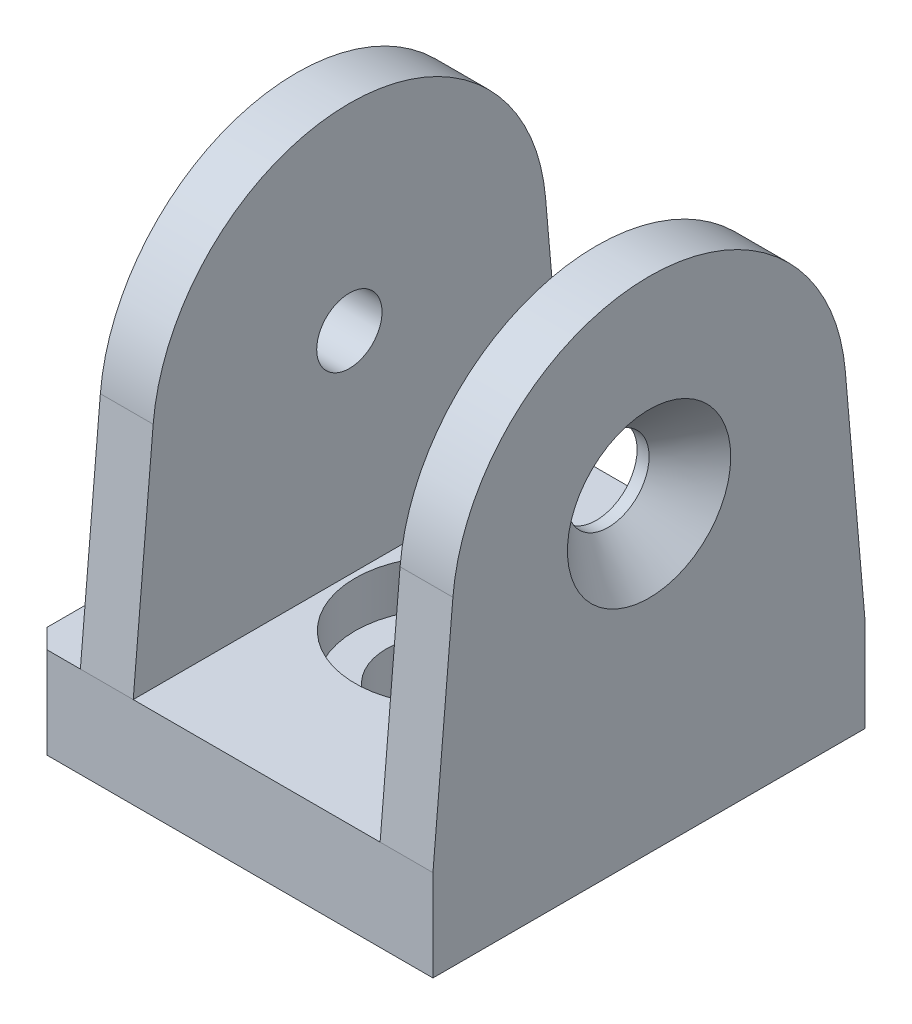
ISO-10303-21;
HEADER;
FILE_DESCRIPTION(('STEP AP214'),'2;1');
FILE_NAME('part.step','',(''),(''),'','','');
FILE_SCHEMA(('AUTOMOTIVE_DESIGN { 1 0 10303 214 1 1 1 1 }'));
ENDSEC;
DATA;
#1=APPLICATION_CONTEXT('core data for automotive mechanical design processes');
#2=APPLICATION_PROTOCOL_DEFINITION('international standard','automotive_design',2000,#1);
#3=PRODUCT_CONTEXT('',#1,'mechanical');
#4=PRODUCT('Part','Part','',(#3));
#5=PRODUCT_RELATED_PRODUCT_CATEGORY('part','',(#4));
#6=PRODUCT_DEFINITION_FORMATION('','',#4);
#7=PRODUCT_DEFINITION_CONTEXT('part definition',#1,'design');
#8=PRODUCT_DEFINITION('design','',#6,#7);
#9=PRODUCT_DEFINITION_SHAPE('','',#8);
#10=(LENGTH_UNIT() NAMED_UNIT(*) SI_UNIT(.MILLI.,.METRE.));
#11=(NAMED_UNIT(*) PLANE_ANGLE_UNIT() SI_UNIT($,.RADIAN.));
#12=(NAMED_UNIT(*) SI_UNIT($,.STERADIAN.) SOLID_ANGLE_UNIT());
#13=UNCERTAINTY_MEASURE_WITH_UNIT(LENGTH_MEASURE(1.E-05),#10,'distance_accuracy_value','');
#14=(GEOMETRIC_REPRESENTATION_CONTEXT(3) GLOBAL_UNCERTAINTY_ASSIGNED_CONTEXT((#13)) GLOBAL_UNIT_ASSIGNED_CONTEXT((#10,
#11,#12)) REPRESENTATION_CONTEXT('',''));
#15=CARTESIAN_POINT('',(0.,0.,0.));
#16=DIRECTION('',(0.,0.,1.));
#17=DIRECTION('',(1.,0.,0.));
#18=AXIS2_PLACEMENT_3D('',#15,#16,#17);
#19=CARTESIAN_POINT('',(-15.6,33.2840876711679,-20.4222190562531));
#20=DIRECTION('',(0.,0.0870286668862405,-0.996205807622102));
#21=DIRECTION('',(0.,0.996205807622102,0.0870286668862405));
#22=AXIS2_PLACEMENT_3D('',#19,#20,#21);
#23=PLANE('',#22);
#24=DIRECTION('',(0.,-0.996205807622102,-0.0870286668862405));
#25=VECTOR('',#24,1.);
#26=CARTESIAN_POINT('',(15.6,33.2840876711679,-20.4222190562531));
#27=LINE('',#26,#25);
#28=CARTESIAN_POINT('',(15.6,33.2840876711679,-20.4222190562531));
#29=VERTEX_POINT('',#28);
#30=CARTESIAN_POINT('',(15.6,9.5,-22.5));
#31=VERTEX_POINT('',#30);
#32=EDGE_CURVE('E145',#29,#31,#27,.T.);
#33=ORIENTED_EDGE('',*,*,#32,.F.);
#34=DIRECTION('',(1.,0.,0.));
#35=VECTOR('',#34,1.);
#36=CARTESIAN_POINT('',(-15.6,33.2840876711679,-20.4222190562531));
#37=LINE('',#36,#35);
#38=CARTESIAN_POINT('',(21.1,33.2840876711679,-20.4222190562531));
#39=VERTEX_POINT('',#38);
#40=EDGE_CURVE('E190',#29,#39,#37,.T.);
#41=ORIENTED_EDGE('',*,*,#40,.T.);
#42=DIRECTION('',(0.,0.996205807622102,0.0870286668862405));
#43=VECTOR('',#42,1.);
#44=CARTESIAN_POINT('',(21.1,33.2840876711679,-20.4222190562531));
#45=LINE('',#44,#43);
#46=CARTESIAN_POINT('',(21.1,9.5,-22.5));
#47=VERTEX_POINT('',#46);
#48=EDGE_CURVE('E258',#47,#39,#45,.T.);
#49=ORIENTED_EDGE('',*,*,#48,.F.);
#50=DIRECTION('',(-1.,0.,0.));
#51=VECTOR('',#50,1.);
#52=CARTESIAN_POINT('',(21.1,9.5,-22.5));
#53=LINE('',#52,#51);
#54=EDGE_CURVE('E211',#47,#31,#53,.T.);
#55=ORIENTED_EDGE('',*,*,#54,.T.);
#56=EDGE_LOOP('',(#33,#41,#49,#55));
#57=FACE_BOUND('',#56,.T.);
#58=ADVANCED_FACE('F39',(#57),#23,.T.);
#59=CARTESIAN_POINT('',(-15.6,31.5,0.));
#60=DIRECTION('',(1.,0.,0.));
#61=DIRECTION('',(0.,0.,-1.));
#62=AXIS2_PLACEMENT_3D('',#59,#60,#61);
#63=CYLINDRICAL_SURFACE('',#62,20.5);
#64=DIRECTION('',(1.,0.,0.));
#65=VECTOR('',#64,1.);
#66=CARTESIAN_POINT('',(-15.6,33.2840876711679,20.4222190562531));
#67=LINE('',#66,#65);
#68=CARTESIAN_POINT('',(-15.6,33.2840876711679,20.4222190562531));
#69=VERTEX_POINT('',#68);
#70=CARTESIAN_POINT('',(-10.1,33.2840876711679,20.4222190562531));
#71=VERTEX_POINT('',#70);
#72=EDGE_CURVE('E178',#69,#71,#67,.T.);
#73=ORIENTED_EDGE('',*,*,#72,.T.);
#74=CARTESIAN_POINT('',(-10.1,31.5,0.));
#75=DIRECTION('',(-1.,0.,0.));
#76=DIRECTION('',(0.,-1.,0.));
#77=AXIS2_PLACEMENT_3D('',#74,#75,#76);
#78=CIRCLE('',#77,20.5);
#79=CARTESIAN_POINT('',(-10.1,33.2840876711679,-20.4222190562531));
#80=VERTEX_POINT('',#79);
#81=EDGE_CURVE('E149',#80,#71,#78,.F.);
#82=ORIENTED_EDGE('',*,*,#81,.F.);
#83=CARTESIAN_POINT('',(-15.6,33.2840876711679,-20.4222190562531));
#84=VERTEX_POINT('',#83);
#85=EDGE_CURVE('E187',#84,#80,#37,.T.);
#86=ORIENTED_EDGE('',*,*,#85,.F.);
#87=CARTESIAN_POINT('',(-15.6,31.5,0.));
#88=DIRECTION('',(1.,0.,0.));
#89=DIRECTION('',(0.,0.,1.));
#90=AXIS2_PLACEMENT_3D('',#87,#88,#89);
#91=CIRCLE('',#90,20.5);
#92=EDGE_CURVE('E313',#84,#69,#91,.T.);
#93=ORIENTED_EDGE('',*,*,#92,.T.);
#94=EDGE_LOOP('',(#73,#82,#86,#93));
#95=FACE_BOUND('',#94,.T.);
#96=ADVANCED_FACE('F273',(#95),#63,.T.);
#97=CARTESIAN_POINT('',(-15.6,9.5,22.5));
#98=DIRECTION('',(0.,0.0870286668862404,0.996205807622102));
#99=DIRECTION('',(0.,-0.996205807622102,0.0870286668862404));
#100=AXIS2_PLACEMENT_3D('',#97,#98,#99);
#101=PLANE('',#100);
#102=DIRECTION('',(0.,0.996205807622102,-0.0870286668862404));
#103=VECTOR('',#102,1.);
#104=CARTESIAN_POINT('',(15.6,9.5,22.5));
#105=LINE('',#104,#103);
#106=CARTESIAN_POINT('',(15.6,9.5,22.5));
#107=VERTEX_POINT('',#106);
#108=CARTESIAN_POINT('',(15.6,33.2840876711679,20.4222190562531));
#109=VERTEX_POINT('',#108);
#110=EDGE_CURVE('E142',#107,#109,#105,.T.);
#111=ORIENTED_EDGE('',*,*,#110,.F.);
#112=DIRECTION('',(1.,0.,0.));
#113=VECTOR('',#112,1.);
#114=CARTESIAN_POINT('',(-15.6,9.5,22.5));
#115=LINE('',#114,#113);
#116=CARTESIAN_POINT('',(21.1,9.5,22.5));
#117=VERTEX_POINT('',#116);
#118=EDGE_CURVE('E167',#107,#117,#115,.T.);
#119=ORIENTED_EDGE('',*,*,#118,.T.);
#120=DIRECTION('',(0.,-0.996205807622102,0.0870286668862404));
#121=VECTOR('',#120,1.);
#122=CARTESIAN_POINT('',(21.1,9.5,22.5));
#123=LINE('',#122,#121);
#124=CARTESIAN_POINT('',(21.1,33.2840876711679,20.4222190562531));
#125=VERTEX_POINT('',#124);
#126=EDGE_CURVE('E184',#125,#117,#123,.T.);
#127=ORIENTED_EDGE('',*,*,#126,.F.);
#128=EDGE_CURVE('E169',#109,#125,#67,.T.);
#129=ORIENTED_EDGE('',*,*,#128,.F.);
#130=EDGE_LOOP('',(#111,#119,#127,#129));
#131=FACE_BOUND('',#130,.T.);
#132=ADVANCED_FACE('F165',(#131),#101,.T.);
#133=CARTESIAN_POINT('',(0.,9.5,0.));
#134=DIRECTION('',(0.,1.,0.));
#135=DIRECTION('',(0.,0.,1.));
#136=AXIS2_PLACEMENT_3D('',#133,#134,#135);
#137=PLANE('',#136);
#138=CARTESIAN_POINT('',(-15.6,9.5,-22.5));
#139=VERTEX_POINT('',#138);
#140=CARTESIAN_POINT('',(-19.1,9.5,-22.5));
#141=VERTEX_POINT('',#140);
#142=EDGE_CURVE('E210',#139,#141,#53,.T.);
#143=ORIENTED_EDGE('',*,*,#142,.T.);
#144=DIRECTION('',(0.707106781186549,0.,-0.707106781186546));
#145=VECTOR('',#144,1.);
#146=CARTESIAN_POINT('',(-20.8,9.5,-20.8));
#147=LINE('',#146,#145);
#148=CARTESIAN_POINT('',(-21.1,9.5,-20.5));
#149=VERTEX_POINT('',#148);
#150=EDGE_CURVE('E48',#141,#149,#147,.F.);
#151=ORIENTED_EDGE('',*,*,#150,.T.);
#152=DIRECTION('',(0.,0.,1.));
#153=VECTOR('',#152,1.);
#154=CARTESIAN_POINT('',(-21.1,9.5,22.5));
#155=LINE('',#154,#153);
#156=CARTESIAN_POINT('',(-21.1,9.5,20.5));
#157=VERTEX_POINT('',#156);
#158=EDGE_CURVE('E205',#149,#157,#155,.T.);
#159=ORIENTED_EDGE('',*,*,#158,.T.);
#160=DIRECTION('',(-0.707106781186546,0.,-0.707106781186549));
#161=VECTOR('',#160,1.);
#162=CARTESIAN_POINT('',(-20.8,9.5,20.8));
#163=LINE('',#162,#161);
#164=CARTESIAN_POINT('',(-19.1,9.5,22.5));
#165=VERTEX_POINT('',#164);
#166=EDGE_CURVE('E55',#157,#165,#163,.F.);
#167=ORIENTED_EDGE('',*,*,#166,.T.);
#168=DIRECTION('',(1.,0.,0.));
#169=VECTOR('',#168,1.);
#170=CARTESIAN_POINT('',(21.1,9.5,22.5));
#171=LINE('',#170,#169);
#172=CARTESIAN_POINT('',(-15.6,9.5,22.5));
#173=VERTEX_POINT('',#172);
#174=EDGE_CURVE('E207',#165,#173,#171,.T.);
#175=ORIENTED_EDGE('',*,*,#174,.T.);
#176=DIRECTION('',(0.,0.,-1.));
#177=VECTOR('',#176,1.);
#178=CARTESIAN_POINT('',(-15.6,9.5,-22.5));
#179=LINE('',#178,#177);
#180=EDGE_CURVE('E318',#173,#139,#179,.T.);
#181=ORIENTED_EDGE('',*,*,#180,.T.);
#182=EDGE_LOOP('',(#143,#151,#159,#167,#175,#181));
#183=FACE_BOUND('',#182,.T.);
#184=ADVANCED_FACE('F238',(#183),#137,.T.);
#185=CARTESIAN_POINT('',(-21.1,9.5,22.5));
#186=DIRECTION('',(1.,0.,0.));
#187=DIRECTION('',(0.,0.,-1.));
#188=AXIS2_PLACEMENT_3D('',#185,#186,#187);
#189=PLANE('',#188);
#190=ORIENTED_EDGE('',*,*,#158,.F.);
#191=DIRECTION('',(0.,-1.,0.));
#192=VECTOR('',#191,1.);
#193=CARTESIAN_POINT('',(-21.1,9.5,-20.5));
#194=LINE('',#193,#192);
#195=CARTESIAN_POINT('',(-21.1,0.,-20.5));
#196=VERTEX_POINT('',#195);
#197=EDGE_CURVE('E228',#149,#196,#194,.T.);
#198=ORIENTED_EDGE('',*,*,#197,.T.);
#199=DIRECTION('',(0.,0.,1.));
#200=VECTOR('',#199,1.);
#201=CARTESIAN_POINT('',(-21.1,0.,22.5));
#202=LINE('',#201,#200);
#203=CARTESIAN_POINT('',(-21.1,0.,20.5));
#204=VERTEX_POINT('',#203);
#205=EDGE_CURVE('E204',#196,#204,#202,.T.);
#206=ORIENTED_EDGE('',*,*,#205,.T.);
#207=DIRECTION('',(0.,1.,0.));
#208=VECTOR('',#207,1.);
#209=CARTESIAN_POINT('',(-21.1,9.5,20.5));
#210=LINE('',#209,#208);
#211=EDGE_CURVE('E170',#204,#157,#210,.T.);
#212=ORIENTED_EDGE('',*,*,#211,.T.);
#213=EDGE_LOOP('',(#190,#198,#206,#212));
#214=FACE_BOUND('',#213,.T.);
#215=ADVANCED_FACE('F243',(#214),#189,.F.);
#216=CARTESIAN_POINT('',(21.1,9.5,22.5));
#217=DIRECTION('',(0.,0.,-1.));
#218=DIRECTION('',(-1.,0.,0.));
#219=AXIS2_PLACEMENT_3D('',#216,#217,#218);
#220=PLANE('',#219);
#221=ORIENTED_EDGE('',*,*,#174,.F.);
#222=DIRECTION('',(0.,-1.,0.));
#223=VECTOR('',#222,1.);
#224=CARTESIAN_POINT('',(-19.1,9.5,22.5));
#225=LINE('',#224,#223);
#226=CARTESIAN_POINT('',(-19.1,0.,22.5));
#227=VERTEX_POINT('',#226);
#228=EDGE_CURVE('E11',#165,#227,#225,.T.);
#229=ORIENTED_EDGE('',*,*,#228,.T.);
#230=DIRECTION('',(1.,0.,0.));
#231=VECTOR('',#230,1.);
#232=CARTESIAN_POINT('',(21.1,0.,22.5));
#233=LINE('',#232,#231);
#234=CARTESIAN_POINT('',(21.1,0.,22.5));
#235=VERTEX_POINT('',#234);
#236=EDGE_CURVE('E218',#227,#235,#233,.T.);
#237=ORIENTED_EDGE('',*,*,#236,.T.);
#238=DIRECTION('',(0.,-1.,0.));
#239=VECTOR('',#238,1.);
#240=CARTESIAN_POINT('',(21.1,9.5,22.5));
#241=LINE('',#240,#239);
#242=EDGE_CURVE('E176',#117,#235,#241,.T.);
#243=ORIENTED_EDGE('',*,*,#242,.F.);
#244=ORIENTED_EDGE('',*,*,#118,.F.);
#245=DIRECTION('',(1.,0.,0.));
#246=VECTOR('',#245,1.);
#247=CARTESIAN_POINT('',(15.6,9.5,22.5));
#248=LINE('',#247,#246);
#249=CARTESIAN_POINT('',(-10.1,9.5,22.5));
#250=VERTEX_POINT('',#249);
#251=EDGE_CURVE('E153',#250,#107,#248,.T.);
#252=ORIENTED_EDGE('',*,*,#251,.F.);
#253=EDGE_CURVE('E177',#173,#250,#115,.T.);
#254=ORIENTED_EDGE('',*,*,#253,.F.);
#255=EDGE_LOOP('',(#221,#229,#237,#243,#244,#252,#254));
#256=FACE_BOUND('',#255,.T.);
#257=ADVANCED_FACE('F174',(#256),#220,.F.);
#258=CARTESIAN_POINT('',(21.1,9.5,22.5));
#259=DIRECTION('',(-1.,0.,0.));
#260=DIRECTION('',(0.,0.,1.));
#261=AXIS2_PLACEMENT_3D('',#258,#259,#260);
#262=PLANE('',#261);
#263=CARTESIAN_POINT('',(21.1,31.5,0.));
#264=DIRECTION('',(1.,0.,0.));
#265=DIRECTION('',(0.,0.,-1.));
#266=AXIS2_PLACEMENT_3D('',#263,#264,#265);
#267=CIRCLE('',#266,8.5);
#268=CARTESIAN_POINT('',(21.1,31.5,-8.5));
#269=VERTEX_POINT('',#268);
#270=EDGE_CURVE('E328',#269,#269,#267,.T.);
#271=ORIENTED_EDGE('',*,*,#270,.F.);
#272=EDGE_LOOP('',(#271));
#273=FACE_BOUND('',#272,.T.);
#274=DIRECTION('',(0.,0.,-1.));
#275=VECTOR('',#274,1.);
#276=CARTESIAN_POINT('',(21.1,0.,22.5));
#277=LINE('',#276,#275);
#278=CARTESIAN_POINT('',(21.1,0.,-22.5));
#279=VERTEX_POINT('',#278);
#280=EDGE_CURVE('E220',#235,#279,#277,.T.);
#281=ORIENTED_EDGE('',*,*,#280,.T.);
#282=DIRECTION('',(0.,-1.,0.));
#283=VECTOR('',#282,1.);
#284=CARTESIAN_POINT('',(21.1,9.5,-22.5));
#285=LINE('',#284,#283);
#286=EDGE_CURVE('E214',#47,#279,#285,.T.);
#287=ORIENTED_EDGE('',*,*,#286,.F.);
#288=ORIENTED_EDGE('',*,*,#48,.T.);
#289=CARTESIAN_POINT('',(21.1,31.5,0.));
#290=DIRECTION('',(1.,0.,0.));
#291=DIRECTION('',(0.,0.,1.));
#292=AXIS2_PLACEMENT_3D('',#289,#290,#291);
#293=CIRCLE('',#292,20.5);
#294=EDGE_CURVE('E306',#39,#125,#293,.T.);
#295=ORIENTED_EDGE('',*,*,#294,.T.);
#296=ORIENTED_EDGE('',*,*,#126,.T.);
#297=ORIENTED_EDGE('',*,*,#242,.T.);
#298=EDGE_LOOP('',(#281,#287,#288,#295,#296,#297));
#299=FACE_BOUND('',#298,.T.);
#300=ADVANCED_FACE('F256',(#273,#299),#262,.F.);
#301=CARTESIAN_POINT('',(21.1,9.5,-22.5));
#302=DIRECTION('',(0.,0.,1.));
#303=DIRECTION('',(1.,0.,0.));
#304=AXIS2_PLACEMENT_3D('',#301,#302,#303);
#305=PLANE('',#304);
#306=DIRECTION('',(-1.,0.,0.));
#307=VECTOR('',#306,1.);
#308=CARTESIAN_POINT('',(21.1,0.,-22.5));
#309=LINE('',#308,#307);
#310=CARTESIAN_POINT('',(-19.1,0.,-22.5));
#311=VERTEX_POINT('',#310);
#312=EDGE_CURVE('E208',#279,#311,#309,.T.);
#313=ORIENTED_EDGE('',*,*,#312,.T.);
#314=DIRECTION('',(0.,1.,0.));
#315=VECTOR('',#314,1.);
#316=CARTESIAN_POINT('',(-19.1,9.5,-22.5));
#317=LINE('',#316,#315);
#318=EDGE_CURVE('E63',#311,#141,#317,.T.);
#319=ORIENTED_EDGE('',*,*,#318,.T.);
#320=ORIENTED_EDGE('',*,*,#142,.F.);
#321=CARTESIAN_POINT('',(-10.1,9.5,-22.5));
#322=VERTEX_POINT('',#321);
#323=EDGE_CURVE('E215',#322,#139,#53,.T.);
#324=ORIENTED_EDGE('',*,*,#323,.F.);
#325=DIRECTION('',(1.,0.,0.));
#326=VECTOR('',#325,1.);
#327=CARTESIAN_POINT('',(15.6,9.5,-22.5));
#328=LINE('',#327,#326);
#329=EDGE_CURVE('E161',#322,#31,#328,.T.);
#330=ORIENTED_EDGE('',*,*,#329,.T.);
#331=ORIENTED_EDGE('',*,*,#54,.F.);
#332=ORIENTED_EDGE('',*,*,#286,.T.);
#333=EDGE_LOOP('',(#313,#319,#320,#324,#330,#331,#332));
#334=FACE_BOUND('',#333,.T.);
#335=ADVANCED_FACE('F251',(#334),#305,.F.);
#336=CARTESIAN_POINT('',(0.,0.,0.));
#337=DIRECTION('',(0.,1.,0.));
#338=DIRECTION('',(0.,0.,1.));
#339=AXIS2_PLACEMENT_3D('',#336,#337,#338);
#340=PLANE('',#339);
#341=CARTESIAN_POINT('',(0.,0.,0.));
#342=DIRECTION('',(0.,1.,0.));
#343=DIRECTION('',(-1.,0.,0.));
#344=AXIS2_PLACEMENT_3D('',#341,#342,#343);
#345=CIRCLE('',#344,6.25);
#346=CARTESIAN_POINT('',(-6.25,0.,0.));
#347=VERTEX_POINT('',#346);
#348=EDGE_CURVE('E201',#347,#347,#345,.T.);
#349=ORIENTED_EDGE('',*,*,#348,.T.);
#350=EDGE_LOOP('',(#349));
#351=FACE_BOUND('',#350,.T.);
#352=ORIENTED_EDGE('',*,*,#205,.F.);
#353=DIRECTION('',(-0.707106781186549,0.,0.707106781186546));
#354=VECTOR('',#353,1.);
#355=CARTESIAN_POINT('',(-21.1,0.,-20.5));
#356=LINE('',#355,#354);
#357=EDGE_CURVE('E233',#196,#311,#356,.F.);
#358=ORIENTED_EDGE('',*,*,#357,.T.);
#359=ORIENTED_EDGE('',*,*,#312,.F.);
#360=ORIENTED_EDGE('',*,*,#280,.F.);
#361=ORIENTED_EDGE('',*,*,#236,.F.);
#362=DIRECTION('',(0.707106781186546,0.,0.707106781186549));
#363=VECTOR('',#362,1.);
#364=CARTESIAN_POINT('',(-19.1,0.,22.5));
#365=LINE('',#364,#363);
#366=EDGE_CURVE('E231',#227,#204,#365,.F.);
#367=ORIENTED_EDGE('',*,*,#366,.T.);
#368=EDGE_LOOP('',(#352,#358,#359,#360,#361,#367));
#369=FACE_BOUND('',#368,.T.);
#370=ADVANCED_FACE('F249',(#351,#369),#340,.F.);
#371=CARTESIAN_POINT('',(0.,9.5,0.));
#372=DIRECTION('',(0.,1.,0.));
#373=DIRECTION('',(-1.,0.,0.));
#374=AXIS2_PLACEMENT_3D('',#371,#372,#373);
#375=CYLINDRICAL_SURFACE('',#374,6.25);
#376=ORIENTED_EDGE('',*,*,#348,.F.);
#377=EDGE_LOOP('',(#376));
#378=FACE_BOUND('',#377,.T.);
#379=CARTESIAN_POINT('',(0.,4.75,0.));
#380=DIRECTION('',(0.,1.,0.));
#381=DIRECTION('',(-1.,0.,0.));
#382=AXIS2_PLACEMENT_3D('',#379,#380,#381);
#383=CIRCLE('',#382,6.25);
#384=CARTESIAN_POINT('',(-6.25,4.75,0.));
#385=VERTEX_POINT('',#384);
#386=EDGE_CURVE('E198',#385,#385,#383,.T.);
#387=ORIENTED_EDGE('',*,*,#386,.T.);
#388=EDGE_LOOP('',(#387));
#389=FACE_BOUND('',#388,.T.);
#390=ADVANCED_FACE('F370',(#378,#389),#375,.F.);
#391=CARTESIAN_POINT('',(-6.25,4.75,0.));
#392=DIRECTION('',(0.,-1.,0.));
#393=DIRECTION('',(1.,0.,0.));
#394=AXIS2_PLACEMENT_3D('',#391,#392,#393);
#395=PLANE('',#394);
#396=ORIENTED_EDGE('',*,*,#386,.F.);
#397=EDGE_LOOP('',(#396));
#398=FACE_BOUND('',#397,.T.);
#399=CARTESIAN_POINT('',(0.,4.75000000000001,0.));
#400=DIRECTION('',(0.,1.,0.));
#401=DIRECTION('',(-1.,0.,0.));
#402=AXIS2_PLACEMENT_3D('',#399,#400,#401);
#403=CIRCLE('',#402,9.5);
#404=CARTESIAN_POINT('',(-9.5,4.75,0.));
#405=VERTEX_POINT('',#404);
#406=EDGE_CURVE('E180',#405,#405,#403,.T.);
#407=ORIENTED_EDGE('',*,*,#406,.T.);
#408=EDGE_LOOP('',(#407));
#409=FACE_BOUND('',#408,.T.);
#410=ADVANCED_FACE('F410',(#398,#409),#395,.F.);
#411=CARTESIAN_POINT('',(0.,9.5,0.));
#412=DIRECTION('',(0.,1.,0.));
#413=DIRECTION('',(-1.,0.,0.));
#414=AXIS2_PLACEMENT_3D('',#411,#412,#413);
#415=CYLINDRICAL_SURFACE('',#414,9.5);
#416=ORIENTED_EDGE('',*,*,#406,.F.);
#417=EDGE_LOOP('',(#416));
#418=FACE_BOUND('',#417,.T.);
#419=CARTESIAN_POINT('',(0.,9.50000000000001,0.));
#420=DIRECTION('',(0.,1.,0.));
#421=DIRECTION('',(-1.,0.,0.));
#422=AXIS2_PLACEMENT_3D('',#419,#420,#421);
#423=CIRCLE('',#422,9.5);
#424=CARTESIAN_POINT('',(-9.5,9.5,0.));
#425=VERTEX_POINT('',#424);
#426=EDGE_CURVE('E191',#425,#425,#423,.T.);
#427=ORIENTED_EDGE('',*,*,#426,.T.);
#428=EDGE_LOOP('',(#427));
#429=FACE_BOUND('',#428,.T.);
#430=ADVANCED_FACE('F293',(#418,#429),#415,.F.);
#431=CARTESIAN_POINT('',(-15.6,31.5,0.));
#432=DIRECTION('',(-1.,0.,0.));
#433=DIRECTION('',(0.,0.,1.));
#434=AXIS2_PLACEMENT_3D('',#431,#432,#433);
#435=PLANE('',#434);
#436=CARTESIAN_POINT('',(-15.6,31.5,0.));
#437=DIRECTION('',(-1.,0.,0.));
#438=DIRECTION('',(0.,0.,1.));
#439=AXIS2_PLACEMENT_3D('',#436,#437,#438);
#440=CIRCLE('',#439,3.4);
#441=CARTESIAN_POINT('',(-15.6,31.5,3.4));
#442=VERTEX_POINT('',#441);
#443=EDGE_CURVE('E334',#442,#442,#440,.T.);
#444=ORIENTED_EDGE('',*,*,#443,.F.);
#445=EDGE_LOOP('',(#444));
#446=FACE_BOUND('',#445,.T.);
#447=ORIENTED_EDGE('',*,*,#180,.F.);
#448=DIRECTION('',(0.,-0.996205807622102,0.0870286668862404));
#449=VECTOR('',#448,1.);
#450=CARTESIAN_POINT('',(-15.6,9.5,22.5));
#451=LINE('',#450,#449);
#452=EDGE_CURVE('E310',#69,#173,#451,.T.);
#453=ORIENTED_EDGE('',*,*,#452,.F.);
#454=ORIENTED_EDGE('',*,*,#92,.F.);
#455=DIRECTION('',(0.,0.996205807622102,0.0870286668862405));
#456=VECTOR('',#455,1.);
#457=CARTESIAN_POINT('',(-15.6,33.2840876711679,-20.4222190562531));
#458=LINE('',#457,#456);
#459=EDGE_CURVE('E316',#139,#84,#458,.T.);
#460=ORIENTED_EDGE('',*,*,#459,.F.);
#461=EDGE_LOOP('',(#447,#453,#454,#460));
#462=FACE_BOUND('',#461,.T.);
#463=ADVANCED_FACE('F285',(#446,#462),#435,.T.);
#464=DIRECTION('',(0.,0.996205807622102,0.0870286668862405));
#465=VECTOR('',#464,1.);
#466=CARTESIAN_POINT('',(-10.1,33.2840876711679,-20.4222190562531));
#467=LINE('',#466,#465);
#468=EDGE_CURVE('E195',#322,#80,#467,.T.);
#469=ORIENTED_EDGE('',*,*,#468,.F.);
#470=ORIENTED_EDGE('',*,*,#323,.T.);
#471=ORIENTED_EDGE('',*,*,#459,.T.);
#472=ORIENTED_EDGE('',*,*,#85,.T.);
#473=EDGE_LOOP('',(#469,#470,#471,#472));
#474=FACE_BOUND('',#473,.T.);
#475=ADVANCED_FACE('F276',(#474),#23,.T.);
#476=CARTESIAN_POINT('',(15.6,31.5,0.));
#477=DIRECTION('',(1.,0.,0.));
#478=DIRECTION('',(0.,0.,-1.));
#479=AXIS2_PLACEMENT_3D('',#476,#477,#478);
#480=CIRCLE('',#479,20.5);
#481=EDGE_CURVE('E194',#109,#29,#480,.F.);
#482=ORIENTED_EDGE('',*,*,#481,.F.);
#483=ORIENTED_EDGE('',*,*,#128,.T.);
#484=ORIENTED_EDGE('',*,*,#294,.F.);
#485=ORIENTED_EDGE('',*,*,#40,.F.);
#486=EDGE_LOOP('',(#482,#483,#484,#485));
#487=FACE_BOUND('',#486,.T.);
#488=ADVANCED_FACE('F282',(#487),#63,.T.);
#489=DIRECTION('',(0.,-0.996205807622102,0.0870286668862404));
#490=VECTOR('',#489,1.);
#491=CARTESIAN_POINT('',(-10.1,9.5,22.5));
#492=LINE('',#491,#490);
#493=EDGE_CURVE('E171',#71,#250,#492,.T.);
#494=ORIENTED_EDGE('',*,*,#493,.F.);
#495=ORIENTED_EDGE('',*,*,#72,.F.);
#496=ORIENTED_EDGE('',*,*,#452,.T.);
#497=ORIENTED_EDGE('',*,*,#253,.T.);
#498=EDGE_LOOP('',(#494,#495,#496,#497));
#499=FACE_BOUND('',#498,.T.);
#500=ADVANCED_FACE('F291',(#499),#101,.T.);
#501=CARTESIAN_POINT('',(15.6,9.5,-22.5));
#502=DIRECTION('',(0.,-1.,0.));
#503=DIRECTION('',(1.,0.,0.));
#504=AXIS2_PLACEMENT_3D('',#501,#502,#503);
#505=PLANE('',#504);
#506=DIRECTION('',(0.,0.,1.));
#507=VECTOR('',#506,1.);
#508=CARTESIAN_POINT('',(15.6,9.5,-22.5));
#509=LINE('',#508,#507);
#510=EDGE_CURVE('E138',#31,#107,#509,.T.);
#511=ORIENTED_EDGE('',*,*,#510,.F.);
#512=ORIENTED_EDGE('',*,*,#329,.F.);
#513=DIRECTION('',(0.,0.,1.));
#514=VECTOR('',#513,1.);
#515=CARTESIAN_POINT('',(-10.1,9.5,-22.5));
#516=LINE('',#515,#514);
#517=EDGE_CURVE('E150',#322,#250,#516,.T.);
#518=ORIENTED_EDGE('',*,*,#517,.T.);
#519=ORIENTED_EDGE('',*,*,#251,.T.);
#520=EDGE_LOOP('',(#511,#512,#518,#519));
#521=FACE_BOUND('',#520,.T.);
#522=ORIENTED_EDGE('',*,*,#426,.F.);
#523=EDGE_LOOP('',(#522));
#524=FACE_BOUND('',#523,.T.);
#525=ADVANCED_FACE('F154',(#521,#524),#505,.F.);
#526=CARTESIAN_POINT('',(15.6,9.5,-22.5));
#527=DIRECTION('',(1.,0.,0.));
#528=DIRECTION('',(0.,0.,-1.));
#529=AXIS2_PLACEMENT_3D('',#526,#527,#528);
#530=PLANE('',#529);
#531=CARTESIAN_POINT('',(15.6,31.5,0.));
#532=DIRECTION('',(1.,0.,0.));
#533=DIRECTION('',(0.,0.,-1.));
#534=AXIS2_PLACEMENT_3D('',#531,#532,#533);
#535=CIRCLE('',#534,4.25);
#536=CARTESIAN_POINT('',(15.6,31.5,-4.25));
#537=VERTEX_POINT('',#536);
#538=EDGE_CURVE('E162',#537,#537,#535,.T.);
#539=ORIENTED_EDGE('',*,*,#538,.T.);
#540=EDGE_LOOP('',(#539));
#541=FACE_BOUND('',#540,.T.);
#542=ORIENTED_EDGE('',*,*,#32,.T.);
#543=ORIENTED_EDGE('',*,*,#510,.T.);
#544=ORIENTED_EDGE('',*,*,#110,.T.);
#545=ORIENTED_EDGE('',*,*,#481,.T.);
#546=EDGE_LOOP('',(#542,#543,#544,#545));
#547=FACE_BOUND('',#546,.T.);
#548=ADVANCED_FACE('F140',(#541,#547),#530,.F.);
#549=CARTESIAN_POINT('',(-10.1,9.5,-22.5));
#550=DIRECTION('',(-1.,0.,0.));
#551=DIRECTION('',(0.,-1.,0.));
#552=AXIS2_PLACEMENT_3D('',#549,#550,#551);
#553=PLANE('',#552);
#554=CARTESIAN_POINT('',(-10.1,31.5,0.));
#555=DIRECTION('',(-1.,0.,0.));
#556=DIRECTION('',(0.,-1.,0.));
#557=AXIS2_PLACEMENT_3D('',#554,#555,#556);
#558=CIRCLE('',#557,3.4);
#559=CARTESIAN_POINT('',(-10.1,28.1,0.));
#560=VERTEX_POINT('',#559);
#561=EDGE_CURVE('E331',#560,#560,#558,.T.);
#562=ORIENTED_EDGE('',*,*,#561,.T.);
#563=EDGE_LOOP('',(#562));
#564=FACE_BOUND('',#563,.T.);
#565=ORIENTED_EDGE('',*,*,#468,.T.);
#566=ORIENTED_EDGE('',*,*,#81,.T.);
#567=ORIENTED_EDGE('',*,*,#493,.T.);
#568=ORIENTED_EDGE('',*,*,#517,.F.);
#569=EDGE_LOOP('',(#565,#566,#567,#568));
#570=FACE_BOUND('',#569,.T.);
#571=ADVANCED_FACE('F271',(#564,#570),#553,.F.);
#572=CARTESIAN_POINT('',(-21.1,9.5,-20.5));
#573=DIRECTION('',(0.707106781186546,0.,0.707106781186549));
#574=DIRECTION('',(0.,-1.,0.));
#575=AXIS2_PLACEMENT_3D('',#572,#573,#574);
#576=PLANE('',#575);
#577=ORIENTED_EDGE('',*,*,#150,.F.);
#578=ORIENTED_EDGE('',*,*,#318,.F.);
#579=ORIENTED_EDGE('',*,*,#357,.F.);
#580=ORIENTED_EDGE('',*,*,#197,.F.);
#581=EDGE_LOOP('',(#577,#578,#579,#580));
#582=FACE_BOUND('',#581,.T.);
#583=ADVANCED_FACE('F246',(#582),#576,.F.);
#584=CARTESIAN_POINT('',(-19.1,9.5,22.5));
#585=DIRECTION('',(0.707106781186549,0.,-0.707106781186546));
#586=DIRECTION('',(0.,-1.,0.));
#587=AXIS2_PLACEMENT_3D('',#584,#585,#586);
#588=PLANE('',#587);
#589=ORIENTED_EDGE('',*,*,#166,.F.);
#590=ORIENTED_EDGE('',*,*,#211,.F.);
#591=ORIENTED_EDGE('',*,*,#366,.F.);
#592=ORIENTED_EDGE('',*,*,#228,.F.);
#593=EDGE_LOOP('',(#589,#590,#591,#592));
#594=FACE_BOUND('',#593,.T.);
#595=ADVANCED_FACE('F42',(#594),#588,.F.);
#596=CARTESIAN_POINT('',(21.1,31.5,0.));
#597=DIRECTION('',(1.,0.,0.));
#598=DIRECTION('',(0.,0.,-1.));
#599=AXIS2_PLACEMENT_3D('',#596,#597,#598);
#600=CYLINDRICAL_SURFACE('',#599,4.25);
#601=ORIENTED_EDGE('',*,*,#538,.F.);
#602=EDGE_LOOP('',(#601));
#603=FACE_BOUND('',#602,.T.);
#604=CARTESIAN_POINT('',(16.85,31.5,0.));
#605=DIRECTION('',(1.,0.,0.));
#606=DIRECTION('',(0.,0.,-1.));
#607=AXIS2_PLACEMENT_3D('',#604,#605,#606);
#608=CIRCLE('',#607,4.25);
#609=CARTESIAN_POINT('',(16.85,31.5,-4.25));
#610=VERTEX_POINT('',#609);
#611=EDGE_CURVE('E325',#610,#610,#608,.T.);
#612=ORIENTED_EDGE('',*,*,#611,.T.);
#613=EDGE_LOOP('',(#612));
#614=FACE_BOUND('',#613,.T.);
#615=ADVANCED_FACE('F263',(#603,#614),#600,.F.);
#616=CARTESIAN_POINT('',(21.1,31.5,0.));
#617=DIRECTION('',(1.,0.,0.));
#618=DIRECTION('',(0.,0.,-1.));
#619=AXIS2_PLACEMENT_3D('',#616,#617,#618);
#620=CONICAL_SURFACE('',#619,8.5,0.785398163397449);
#621=ORIENTED_EDGE('',*,*,#611,.F.);
#622=EDGE_LOOP('',(#621));
#623=FACE_BOUND('',#622,.T.);
#624=ORIENTED_EDGE('',*,*,#270,.T.);
#625=EDGE_LOOP('',(#624));
#626=FACE_BOUND('',#625,.T.);
#627=ADVANCED_FACE('F268',(#623,#626),#620,.F.);
#628=CARTESIAN_POINT('',(-15.6,31.5,0.));
#629=DIRECTION('',(-1.,0.,0.));
#630=DIRECTION('',(0.,0.,1.));
#631=AXIS2_PLACEMENT_3D('',#628,#629,#630);
#632=CYLINDRICAL_SURFACE('',#631,3.4);
#633=ORIENTED_EDGE('',*,*,#561,.F.);
#634=EDGE_LOOP('',(#633));
#635=FACE_BOUND('',#634,.T.);
#636=ORIENTED_EDGE('',*,*,#443,.T.);
#637=EDGE_LOOP('',(#636));
#638=FACE_BOUND('',#637,.T.);
#639=ADVANCED_FACE('F338',(#635,#638),#632,.F.);
#640=CLOSED_SHELL('',(#58,#96,#132,#184,#215,#257,#300,#335,#370,#390,#410,#430,#463,#475,#488,
#500,#525,#548,#571,#583,#595,#615,#627,#639));
#641=MANIFOLD_SOLID_BREP('B2',#640);
#642=ADVANCED_BREP_SHAPE_REPRESENTATION('',(#18,#641),#14);
#643=SHAPE_DEFINITION_REPRESENTATION(#9,#642);
ENDSEC;
END-ISO-10303-21;
